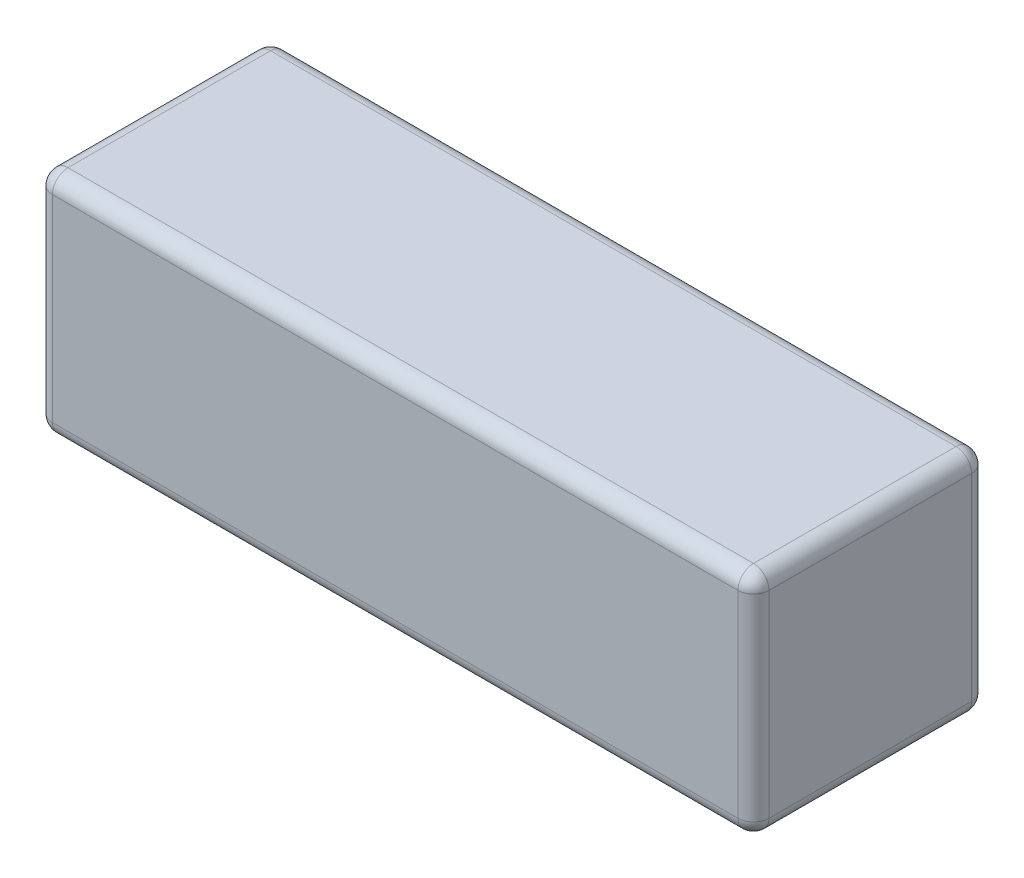
ISO-10303-21;
HEADER;
FILE_DESCRIPTION(('STEP AP214'),'2;1');
FILE_NAME('part.step','',(''),(''),'','','');
FILE_SCHEMA(('AUTOMOTIVE_DESIGN { 1 0 10303 214 1 1 1 1 }'));
ENDSEC;
DATA;
#1=APPLICATION_CONTEXT('core data for automotive mechanical design processes');
#2=APPLICATION_PROTOCOL_DEFINITION('international standard','automotive_design',2000,#1);
#3=PRODUCT_CONTEXT('',#1,'mechanical');
#4=PRODUCT('Part','Part','',(#3));
#5=PRODUCT_RELATED_PRODUCT_CATEGORY('part','',(#4));
#6=PRODUCT_DEFINITION_FORMATION('','',#4);
#7=PRODUCT_DEFINITION_CONTEXT('part definition',#1,'design');
#8=PRODUCT_DEFINITION('design','',#6,#7);
#9=PRODUCT_DEFINITION_SHAPE('','',#8);
#10=(LENGTH_UNIT() NAMED_UNIT(*) SI_UNIT(.MILLI.,.METRE.));
#11=(NAMED_UNIT(*) PLANE_ANGLE_UNIT() SI_UNIT($,.RADIAN.));
#12=(NAMED_UNIT(*) SI_UNIT($,.STERADIAN.) SOLID_ANGLE_UNIT());
#13=UNCERTAINTY_MEASURE_WITH_UNIT(LENGTH_MEASURE(1.E-05),#10,'distance_accuracy_value','');
#14=(GEOMETRIC_REPRESENTATION_CONTEXT(3) GLOBAL_UNCERTAINTY_ASSIGNED_CONTEXT((#13)) GLOBAL_UNIT_ASSIGNED_CONTEXT((#10,
#11,#12)) REPRESENTATION_CONTEXT('',''));
#15=CARTESIAN_POINT('',(0.,0.,0.));
#16=DIRECTION('',(0.,0.,1.));
#17=DIRECTION('',(1.,0.,0.));
#18=AXIS2_PLACEMENT_3D('',#15,#16,#17);
#19=CARTESIAN_POINT('',(-69.,-22.,45.));
#20=DIRECTION('',(1.,0.,0.));
#21=DIRECTION('',(0.,0.,-1.));
#22=AXIS2_PLACEMENT_3D('',#19,#20,#21);
#23=PLANE('',#22);
#24=DIRECTION('',(0.,-1.,0.));
#25=VECTOR('',#24,1.);
#26=CARTESIAN_POINT('',(-69.,22.,42.));
#27=LINE('',#26,#25);
#28=CARTESIAN_POINT('',(-69.,-19.,42.));
#29=VERTEX_POINT('',#28);
#30=CARTESIAN_POINT('',(-69.,19.,42.));
#31=VERTEX_POINT('',#30);
#32=EDGE_CURVE('E133',#29,#31,#27,.F.);
#33=ORIENTED_EDGE('',*,*,#32,.T.);
#34=DIRECTION('',(0.,0.,-1.));
#35=VECTOR('',#34,1.);
#36=CARTESIAN_POINT('',(-69.,19.,45.));
#37=LINE('',#36,#35);
#38=CARTESIAN_POINT('',(-69.,19.,3.));
#39=VERTEX_POINT('',#38);
#40=EDGE_CURVE('E170',#31,#39,#37,.T.);
#41=ORIENTED_EDGE('',*,*,#40,.T.);
#42=DIRECTION('',(0.,-1.,0.));
#43=VECTOR('',#42,1.);
#44=CARTESIAN_POINT('',(-69.,-22.,3.));
#45=LINE('',#44,#43);
#46=CARTESIAN_POINT('',(-69.,-19.,3.));
#47=VERTEX_POINT('',#46);
#48=EDGE_CURVE('E136',#39,#47,#45,.T.);
#49=ORIENTED_EDGE('',*,*,#48,.T.);
#50=DIRECTION('',(0.,0.,-1.));
#51=VECTOR('',#50,1.);
#52=CARTESIAN_POINT('',(-69.,-19.,45.));
#53=LINE('',#52,#51);
#54=EDGE_CURVE('E129',#47,#29,#53,.F.);
#55=ORIENTED_EDGE('',*,*,#54,.T.);
#56=EDGE_LOOP('',(#33,#41,#49,#55));
#57=FACE_BOUND('',#56,.T.);
#58=ADVANCED_FACE('F41',(#57),#23,.F.);
#59=CARTESIAN_POINT('',(69.,-22.,45.));
#60=DIRECTION('',(0.,1.,0.));
#61=DIRECTION('',(-1.,0.,0.));
#62=AXIS2_PLACEMENT_3D('',#59,#60,#61);
#63=PLANE('',#62);
#64=DIRECTION('',(1.,0.,0.));
#65=VECTOR('',#64,1.);
#66=CARTESIAN_POINT('',(-69.,-22.,42.));
#67=LINE('',#66,#65);
#68=CARTESIAN_POINT('',(66.,-22.,42.));
#69=VERTEX_POINT('',#68);
#70=CARTESIAN_POINT('',(-66.,-22.,42.));
#71=VERTEX_POINT('',#70);
#72=EDGE_CURVE('E190',#69,#71,#67,.F.);
#73=ORIENTED_EDGE('',*,*,#72,.T.);
#74=DIRECTION('',(0.,0.,-1.));
#75=VECTOR('',#74,1.);
#76=CARTESIAN_POINT('',(-66.,-22.,45.));
#77=LINE('',#76,#75);
#78=CARTESIAN_POINT('',(-66.,-22.,3.));
#79=VERTEX_POINT('',#78);
#80=EDGE_CURVE('E147',#71,#79,#77,.T.);
#81=ORIENTED_EDGE('',*,*,#80,.T.);
#82=DIRECTION('',(1.,0.,0.));
#83=VECTOR('',#82,1.);
#84=CARTESIAN_POINT('',(69.,-22.,3.));
#85=LINE('',#84,#83);
#86=CARTESIAN_POINT('',(66.,-22.,3.));
#87=VERTEX_POINT('',#86);
#88=EDGE_CURVE('E194',#79,#87,#85,.T.);
#89=ORIENTED_EDGE('',*,*,#88,.T.);
#90=DIRECTION('',(0.,0.,-1.));
#91=VECTOR('',#90,1.);
#92=CARTESIAN_POINT('',(66.,-22.,45.));
#93=LINE('',#92,#91);
#94=EDGE_CURVE('E192',#87,#69,#93,.F.);
#95=ORIENTED_EDGE('',*,*,#94,.T.);
#96=EDGE_LOOP('',(#73,#81,#89,#95));
#97=FACE_BOUND('',#96,.T.);
#98=ADVANCED_FACE('F304',(#97),#63,.F.);
#99=CARTESIAN_POINT('',(69.,-22.,45.));
#100=DIRECTION('',(-1.,0.,0.));
#101=DIRECTION('',(0.,0.,1.));
#102=AXIS2_PLACEMENT_3D('',#99,#100,#101);
#103=PLANE('',#102);
#104=DIRECTION('',(0.,0.,-1.));
#105=VECTOR('',#104,1.);
#106=CARTESIAN_POINT('',(69.,-19.,45.));
#107=LINE('',#106,#105);
#108=CARTESIAN_POINT('',(69.,-19.,42.));
#109=VERTEX_POINT('',#108);
#110=CARTESIAN_POINT('',(69.,-19.,3.));
#111=VERTEX_POINT('',#110);
#112=EDGE_CURVE('E201',#109,#111,#107,.T.);
#113=ORIENTED_EDGE('',*,*,#112,.T.);
#114=DIRECTION('',(0.,1.,0.));
#115=VECTOR('',#114,1.);
#116=CARTESIAN_POINT('',(69.,-22.,3.));
#117=LINE('',#116,#115);
#118=CARTESIAN_POINT('',(69.,19.,3.));
#119=VERTEX_POINT('',#118);
#120=EDGE_CURVE('E204',#111,#119,#117,.T.);
#121=ORIENTED_EDGE('',*,*,#120,.T.);
#122=DIRECTION('',(0.,0.,-1.));
#123=VECTOR('',#122,1.);
#124=CARTESIAN_POINT('',(69.,19.,45.));
#125=LINE('',#124,#123);
#126=CARTESIAN_POINT('',(69.,19.,42.));
#127=VERTEX_POINT('',#126);
#128=EDGE_CURVE('E199',#119,#127,#125,.F.);
#129=ORIENTED_EDGE('',*,*,#128,.T.);
#130=DIRECTION('',(0.,1.,0.));
#131=VECTOR('',#130,1.);
#132=CARTESIAN_POINT('',(69.,-22.,42.));
#133=LINE('',#132,#131);
#134=EDGE_CURVE('E197',#127,#109,#133,.F.);
#135=ORIENTED_EDGE('',*,*,#134,.T.);
#136=EDGE_LOOP('',(#113,#121,#129,#135));
#137=FACE_BOUND('',#136,.T.);
#138=ADVANCED_FACE('F281',(#137),#103,.F.);
#139=CARTESIAN_POINT('',(69.,22.,45.));
#140=DIRECTION('',(0.,-1.,0.));
#141=DIRECTION('',(1.,0.,0.));
#142=AXIS2_PLACEMENT_3D('',#139,#140,#141);
#143=PLANE('',#142);
#144=DIRECTION('',(-1.,0.,0.));
#145=VECTOR('',#144,1.);
#146=CARTESIAN_POINT('',(69.,22.,3.));
#147=LINE('',#146,#145);
#148=CARTESIAN_POINT('',(66.,22.,3.));
#149=VERTEX_POINT('',#148);
#150=CARTESIAN_POINT('',(-66.,22.,3.));
#151=VERTEX_POINT('',#150);
#152=EDGE_CURVE('E176',#149,#151,#147,.T.);
#153=ORIENTED_EDGE('',*,*,#152,.T.);
#154=DIRECTION('',(0.,0.,-1.));
#155=VECTOR('',#154,1.);
#156=CARTESIAN_POINT('',(-66.,22.,45.));
#157=LINE('',#156,#155);
#158=CARTESIAN_POINT('',(-66.,22.,42.));
#159=VERTEX_POINT('',#158);
#160=EDGE_CURVE('E178',#151,#159,#157,.F.);
#161=ORIENTED_EDGE('',*,*,#160,.T.);
#162=DIRECTION('',(-1.,0.,0.));
#163=VECTOR('',#162,1.);
#164=CARTESIAN_POINT('',(69.,22.,42.));
#165=LINE('',#164,#163);
#166=CARTESIAN_POINT('',(66.,22.,42.));
#167=VERTEX_POINT('',#166);
#168=EDGE_CURVE('E172',#159,#167,#165,.F.);
#169=ORIENTED_EDGE('',*,*,#168,.T.);
#170=DIRECTION('',(0.,0.,-1.));
#171=VECTOR('',#170,1.);
#172=CARTESIAN_POINT('',(66.,22.,45.));
#173=LINE('',#172,#171);
#174=EDGE_CURVE('E174',#167,#149,#173,.T.);
#175=ORIENTED_EDGE('',*,*,#174,.T.);
#176=EDGE_LOOP('',(#153,#161,#169,#175));
#177=FACE_BOUND('',#176,.T.);
#178=ADVANCED_FACE('F311',(#177),#143,.F.);
#179=CARTESIAN_POINT('',(0.,0.,45.));
#180=DIRECTION('',(0.,0.,1.));
#181=DIRECTION('',(1.,0.,0.));
#182=AXIS2_PLACEMENT_3D('',#179,#180,#181);
#183=PLANE('',#182);
#184=DIRECTION('',(0.,1.,0.));
#185=VECTOR('',#184,1.);
#186=CARTESIAN_POINT('',(66.,22.,45.));
#187=LINE('',#186,#185);
#188=CARTESIAN_POINT('',(66.,-19.,45.));
#189=VERTEX_POINT('',#188);
#190=CARTESIAN_POINT('',(66.,19.,45.));
#191=VERTEX_POINT('',#190);
#192=EDGE_CURVE('E50',#189,#191,#187,.T.);
#193=ORIENTED_EDGE('',*,*,#192,.T.);
#194=DIRECTION('',(-1.,0.,0.));
#195=VECTOR('',#194,1.);
#196=CARTESIAN_POINT('',(-69.,19.,45.));
#197=LINE('',#196,#195);
#198=CARTESIAN_POINT('',(-66.,19.,45.));
#199=VERTEX_POINT('',#198);
#200=EDGE_CURVE('E11',#191,#199,#197,.T.);
#201=ORIENTED_EDGE('',*,*,#200,.T.);
#202=DIRECTION('',(0.,-1.,0.));
#203=VECTOR('',#202,1.);
#204=CARTESIAN_POINT('',(-66.,-22.,45.));
#205=LINE('',#204,#203);
#206=CARTESIAN_POINT('',(-66.,-19.,45.));
#207=VERTEX_POINT('',#206);
#208=EDGE_CURVE('E206',#199,#207,#205,.T.);
#209=ORIENTED_EDGE('',*,*,#208,.T.);
#210=DIRECTION('',(1.,0.,0.));
#211=VECTOR('',#210,1.);
#212=CARTESIAN_POINT('',(69.,-19.,45.));
#213=LINE('',#212,#211);
#214=EDGE_CURVE('E61',#207,#189,#213,.T.);
#215=ORIENTED_EDGE('',*,*,#214,.T.);
#216=EDGE_LOOP('',(#193,#201,#209,#215));
#217=FACE_BOUND('',#216,.T.);
#218=ADVANCED_FACE('F374',(#217),#183,.T.);
#219=CARTESIAN_POINT('',(0.,0.,0.));
#220=DIRECTION('',(0.,0.,1.));
#221=DIRECTION('',(1.,0.,0.));
#222=AXIS2_PLACEMENT_3D('',#219,#220,#221);
#223=PLANE('',#222);
#224=DIRECTION('',(0.,-1.,0.));
#225=VECTOR('',#224,1.);
#226=CARTESIAN_POINT('',(-66.,0.,0.));
#227=LINE('',#226,#225);
#228=CARTESIAN_POINT('',(-66.,-19.,0.));
#229=VERTEX_POINT('',#228);
#230=CARTESIAN_POINT('',(-66.,19.,0.));
#231=VERTEX_POINT('',#230);
#232=EDGE_CURVE('E185',#229,#231,#227,.F.);
#233=ORIENTED_EDGE('',*,*,#232,.T.);
#234=DIRECTION('',(-1.,0.,0.));
#235=VECTOR('',#234,1.);
#236=CARTESIAN_POINT('',(0.,19.,0.));
#237=LINE('',#236,#235);
#238=CARTESIAN_POINT('',(66.,19.,0.));
#239=VERTEX_POINT('',#238);
#240=EDGE_CURVE('E187',#231,#239,#237,.F.);
#241=ORIENTED_EDGE('',*,*,#240,.T.);
#242=DIRECTION('',(0.,1.,0.));
#243=VECTOR('',#242,1.);
#244=CARTESIAN_POINT('',(66.,0.,0.));
#245=LINE('',#244,#243);
#246=CARTESIAN_POINT('',(66.,-19.,0.));
#247=VERTEX_POINT('',#246);
#248=EDGE_CURVE('E181',#239,#247,#245,.F.);
#249=ORIENTED_EDGE('',*,*,#248,.T.);
#250=DIRECTION('',(1.,0.,0.));
#251=VECTOR('',#250,1.);
#252=CARTESIAN_POINT('',(0.,-19.,0.));
#253=LINE('',#252,#251);
#254=EDGE_CURVE('E183',#247,#229,#253,.F.);
#255=ORIENTED_EDGE('',*,*,#254,.T.);
#256=EDGE_LOOP('',(#233,#241,#249,#255));
#257=FACE_BOUND('',#256,.T.);
#258=ADVANCED_FACE('F272',(#257),#223,.F.);
#259=CARTESIAN_POINT('',(66.,-19.,45.));
#260=DIRECTION('',(0.,0.,-1.));
#261=DIRECTION('',(-1.,0.,0.));
#262=AXIS2_PLACEMENT_3D('',#259,#260,#261);
#263=CYLINDRICAL_SURFACE('',#262,3.);
#264=CARTESIAN_POINT('',(66.,-19.,42.));
#265=DIRECTION('',(0.,0.,1.));
#266=DIRECTION('',(1.,0.,0.));
#267=AXIS2_PLACEMENT_3D('',#264,#265,#266);
#268=CIRCLE('',#267,3.);
#269=EDGE_CURVE('E45',#69,#109,#268,.T.);
#270=ORIENTED_EDGE('',*,*,#269,.F.);
#271=ORIENTED_EDGE('',*,*,#94,.F.);
#272=CARTESIAN_POINT('',(66.,-19.,3.));
#273=DIRECTION('',(0.,0.,-1.));
#274=DIRECTION('',(-1.,0.,0.));
#275=AXIS2_PLACEMENT_3D('',#272,#273,#274);
#276=CIRCLE('',#275,3.);
#277=EDGE_CURVE('E167',#111,#87,#276,.T.);
#278=ORIENTED_EDGE('',*,*,#277,.F.);
#279=ORIENTED_EDGE('',*,*,#112,.F.);
#280=EDGE_LOOP('',(#270,#271,#278,#279));
#281=FACE_BOUND('',#280,.T.);
#282=ADVANCED_FACE('F43',(#281),#263,.T.);
#283=CARTESIAN_POINT('',(66.,-19.,42.));
#284=DIRECTION('',(1.,0.,0.));
#285=DIRECTION('',(0.,0.,-1.));
#286=AXIS2_PLACEMENT_3D('',#283,#284,#285);
#287=SPHERICAL_SURFACE('',#286,3.);
#288=CARTESIAN_POINT('',(66.,-19.,42.));
#289=DIRECTION('',(1.,0.,0.));
#290=DIRECTION('',(0.,0.,-1.));
#291=AXIS2_PLACEMENT_3D('',#288,#289,#290);
#292=CIRCLE('',#291,3.);
#293=EDGE_CURVE('E252',#69,#189,#292,.F.);
#294=ORIENTED_EDGE('',*,*,#293,.F.);
#295=ORIENTED_EDGE('',*,*,#269,.T.);
#296=CARTESIAN_POINT('',(66.,-19.,42.));
#297=DIRECTION('',(0.,-1.,0.));
#298=DIRECTION('',(0.,0.,-1.));
#299=AXIS2_PLACEMENT_3D('',#296,#297,#298);
#300=CIRCLE('',#299,3.);
#301=EDGE_CURVE('E254',#189,#109,#300,.F.);
#302=ORIENTED_EDGE('',*,*,#301,.F.);
#303=EDGE_LOOP('',(#294,#295,#302));
#304=FACE_BOUND('',#303,.T.);
#305=ADVANCED_FACE('F299',(#304),#287,.T.);
#306=CARTESIAN_POINT('',(66.,-19.,3.));
#307=DIRECTION('',(0.,-1.,0.));
#308=DIRECTION('',(0.,0.,-1.));
#309=AXIS2_PLACEMENT_3D('',#306,#307,#308);
#310=SPHERICAL_SURFACE('',#309,3.);
#311=CARTESIAN_POINT('',(66.,-19.,3.));
#312=DIRECTION('',(0.,-1.,0.));
#313=DIRECTION('',(0.,0.,-1.));
#314=AXIS2_PLACEMENT_3D('',#311,#312,#313);
#315=CIRCLE('',#314,3.);
#316=EDGE_CURVE('E246',#111,#247,#315,.F.);
#317=ORIENTED_EDGE('',*,*,#316,.F.);
#318=ORIENTED_EDGE('',*,*,#277,.T.);
#319=CARTESIAN_POINT('',(66.,-19.,3.));
#320=DIRECTION('',(1.,0.,0.));
#321=DIRECTION('',(0.,0.,-1.));
#322=AXIS2_PLACEMENT_3D('',#319,#320,#321);
#323=CIRCLE('',#322,3.);
#324=EDGE_CURVE('E249',#247,#87,#323,.F.);
#325=ORIENTED_EDGE('',*,*,#324,.F.);
#326=EDGE_LOOP('',(#317,#318,#325));
#327=FACE_BOUND('',#326,.T.);
#328=ADVANCED_FACE('F261',(#327),#310,.T.);
#329=CARTESIAN_POINT('',(66.,0.,42.));
#330=DIRECTION('',(0.,-1.,0.));
#331=DIRECTION('',(0.,0.,-1.));
#332=AXIS2_PLACEMENT_3D('',#329,#330,#331);
#333=CYLINDRICAL_SURFACE('',#332,3.);
#334=ORIENTED_EDGE('',*,*,#301,.T.);
#335=ORIENTED_EDGE('',*,*,#134,.F.);
#336=CARTESIAN_POINT('',(66.,19.,42.));
#337=DIRECTION('',(0.,1.,0.));
#338=DIRECTION('',(0.,0.,1.));
#339=AXIS2_PLACEMENT_3D('',#336,#337,#338);
#340=CIRCLE('',#339,3.);
#341=EDGE_CURVE('E240',#191,#127,#340,.T.);
#342=ORIENTED_EDGE('',*,*,#341,.F.);
#343=ORIENTED_EDGE('',*,*,#192,.F.);
#344=EDGE_LOOP('',(#334,#335,#342,#343));
#345=FACE_BOUND('',#344,.T.);
#346=ADVANCED_FACE('F294',(#345),#333,.T.);
#347=CARTESIAN_POINT('',(0.,-19.,42.));
#348=DIRECTION('',(-1.,0.,0.));
#349=DIRECTION('',(0.,-1.,0.));
#350=AXIS2_PLACEMENT_3D('',#347,#348,#349);
#351=CYLINDRICAL_SURFACE('',#350,3.);
#352=ORIENTED_EDGE('',*,*,#293,.T.);
#353=ORIENTED_EDGE('',*,*,#214,.F.);
#354=CARTESIAN_POINT('',(-66.,-19.,42.));
#355=DIRECTION('',(-1.,0.,0.));
#356=DIRECTION('',(0.,0.,1.));
#357=AXIS2_PLACEMENT_3D('',#354,#355,#356);
#358=CIRCLE('',#357,3.);
#359=EDGE_CURVE('E151',#71,#207,#358,.T.);
#360=ORIENTED_EDGE('',*,*,#359,.F.);
#361=ORIENTED_EDGE('',*,*,#72,.F.);
#362=EDGE_LOOP('',(#352,#353,#360,#361));
#363=FACE_BOUND('',#362,.T.);
#364=ADVANCED_FACE('F302',(#363),#351,.T.);
#365=CARTESIAN_POINT('',(-66.,-19.,45.));
#366=DIRECTION('',(0.,0.,-1.));
#367=DIRECTION('',(-1.,0.,0.));
#368=AXIS2_PLACEMENT_3D('',#365,#366,#367);
#369=CYLINDRICAL_SURFACE('',#368,3.);
#370=CARTESIAN_POINT('',(-66.,-19.,3.));
#371=DIRECTION('',(0.,0.,-1.));
#372=DIRECTION('',(-1.,0.,0.));
#373=AXIS2_PLACEMENT_3D('',#370,#371,#372);
#374=CIRCLE('',#373,3.);
#375=EDGE_CURVE('E152',#79,#47,#374,.T.);
#376=ORIENTED_EDGE('',*,*,#375,.F.);
#377=ORIENTED_EDGE('',*,*,#80,.F.);
#378=CARTESIAN_POINT('',(-66.,-19.,42.));
#379=DIRECTION('',(0.,0.,1.));
#380=DIRECTION('',(1.,0.,0.));
#381=AXIS2_PLACEMENT_3D('',#378,#379,#380);
#382=CIRCLE('',#381,3.);
#383=EDGE_CURVE('E143',#29,#71,#382,.T.);
#384=ORIENTED_EDGE('',*,*,#383,.F.);
#385=ORIENTED_EDGE('',*,*,#54,.F.);
#386=EDGE_LOOP('',(#376,#377,#384,#385));
#387=FACE_BOUND('',#386,.T.);
#388=ADVANCED_FACE('F145',(#387),#369,.T.);
#389=CARTESIAN_POINT('',(69.,-19.,3.));
#390=DIRECTION('',(1.,0.,0.));
#391=DIRECTION('',(0.,1.,0.));
#392=AXIS2_PLACEMENT_3D('',#389,#390,#391);
#393=CYLINDRICAL_SURFACE('',#392,3.);
#394=ORIENTED_EDGE('',*,*,#324,.T.);
#395=ORIENTED_EDGE('',*,*,#88,.F.);
#396=CARTESIAN_POINT('',(-66.,-19.,3.));
#397=DIRECTION('',(-1.,0.,0.));
#398=DIRECTION('',(0.,-1.,0.));
#399=AXIS2_PLACEMENT_3D('',#396,#397,#398);
#400=CIRCLE('',#399,3.);
#401=EDGE_CURVE('E236',#229,#79,#400,.T.);
#402=ORIENTED_EDGE('',*,*,#401,.F.);
#403=ORIENTED_EDGE('',*,*,#254,.F.);
#404=EDGE_LOOP('',(#394,#395,#402,#403));
#405=FACE_BOUND('',#404,.T.);
#406=ADVANCED_FACE('F268',(#405),#393,.T.);
#407=CARTESIAN_POINT('',(66.,-22.,3.));
#408=DIRECTION('',(0.,1.,0.));
#409=DIRECTION('',(0.,0.,1.));
#410=AXIS2_PLACEMENT_3D('',#407,#408,#409);
#411=CYLINDRICAL_SURFACE('',#410,3.);
#412=ORIENTED_EDGE('',*,*,#316,.T.);
#413=ORIENTED_EDGE('',*,*,#248,.F.);
#414=CARTESIAN_POINT('',(66.,19.,3.));
#415=DIRECTION('',(0.,1.,0.));
#416=DIRECTION('',(0.,0.,1.));
#417=AXIS2_PLACEMENT_3D('',#414,#415,#416);
#418=CIRCLE('',#417,3.);
#419=EDGE_CURVE('E233',#119,#239,#418,.T.);
#420=ORIENTED_EDGE('',*,*,#419,.F.);
#421=ORIENTED_EDGE('',*,*,#120,.F.);
#422=EDGE_LOOP('',(#412,#413,#420,#421));
#423=FACE_BOUND('',#422,.T.);
#424=ADVANCED_FACE('F278',(#423),#411,.T.);
#425=CARTESIAN_POINT('',(66.,19.,45.));
#426=DIRECTION('',(0.,0.,-1.));
#427=DIRECTION('',(-1.,0.,0.));
#428=AXIS2_PLACEMENT_3D('',#425,#426,#427);
#429=CYLINDRICAL_SURFACE('',#428,3.);
#430=CARTESIAN_POINT('',(66.,19.,42.));
#431=DIRECTION('',(0.,0.,1.));
#432=DIRECTION('',(1.,0.,0.));
#433=AXIS2_PLACEMENT_3D('',#430,#431,#432);
#434=CIRCLE('',#433,3.);
#435=EDGE_CURVE('E243',#127,#167,#434,.T.);
#436=ORIENTED_EDGE('',*,*,#435,.F.);
#437=ORIENTED_EDGE('',*,*,#128,.F.);
#438=CARTESIAN_POINT('',(66.,19.,3.));
#439=DIRECTION('',(0.,0.,-1.));
#440=DIRECTION('',(-1.,0.,0.));
#441=AXIS2_PLACEMENT_3D('',#438,#439,#440);
#442=CIRCLE('',#441,3.);
#443=EDGE_CURVE('E230',#149,#119,#442,.T.);
#444=ORIENTED_EDGE('',*,*,#443,.F.);
#445=ORIENTED_EDGE('',*,*,#174,.F.);
#446=EDGE_LOOP('',(#436,#437,#444,#445));
#447=FACE_BOUND('',#446,.T.);
#448=ADVANCED_FACE('F286',(#447),#429,.T.);
#449=CARTESIAN_POINT('',(66.,19.,42.));
#450=DIRECTION('',(1.,0.,0.));
#451=DIRECTION('',(0.,0.,-1.));
#452=AXIS2_PLACEMENT_3D('',#449,#450,#451);
#453=SPHERICAL_SURFACE('',#452,3.);
#454=ORIENTED_EDGE('',*,*,#341,.T.);
#455=ORIENTED_EDGE('',*,*,#435,.T.);
#456=CARTESIAN_POINT('',(66.,19.,42.));
#457=DIRECTION('',(1.,0.,0.));
#458=DIRECTION('',(0.,0.,-1.));
#459=AXIS2_PLACEMENT_3D('',#456,#457,#458);
#460=CIRCLE('',#459,3.);
#461=EDGE_CURVE('E159',#191,#167,#460,.F.);
#462=ORIENTED_EDGE('',*,*,#461,.F.);
#463=EDGE_LOOP('',(#454,#455,#462));
#464=FACE_BOUND('',#463,.T.);
#465=ADVANCED_FACE('F291',(#464),#453,.T.);
#466=CARTESIAN_POINT('',(-66.,-19.,42.));
#467=DIRECTION('',(0.,-1.,0.));
#468=DIRECTION('',(1.,0.,0.));
#469=AXIS2_PLACEMENT_3D('',#466,#467,#468);
#470=SPHERICAL_SURFACE('',#469,3.);
#471=ORIENTED_EDGE('',*,*,#383,.T.);
#472=ORIENTED_EDGE('',*,*,#359,.T.);
#473=CARTESIAN_POINT('',(-66.,-19.,42.));
#474=DIRECTION('',(0.,-1.,0.));
#475=DIRECTION('',(0.,0.,-1.));
#476=AXIS2_PLACEMENT_3D('',#473,#474,#475);
#477=CIRCLE('',#476,3.);
#478=EDGE_CURVE('E155',#29,#207,#477,.F.);
#479=ORIENTED_EDGE('',*,*,#478,.F.);
#480=EDGE_LOOP('',(#471,#472,#479));
#481=FACE_BOUND('',#480,.T.);
#482=ADVANCED_FACE('F156',(#481),#470,.T.);
#483=CARTESIAN_POINT('',(-66.,-19.,3.));
#484=DIRECTION('',(0.,-1.,0.));
#485=DIRECTION('',(1.,0.,0.));
#486=AXIS2_PLACEMENT_3D('',#483,#484,#485);
#487=SPHERICAL_SURFACE('',#486,3.);
#488=ORIENTED_EDGE('',*,*,#401,.T.);
#489=ORIENTED_EDGE('',*,*,#375,.T.);
#490=CARTESIAN_POINT('',(-66.,-19.,3.));
#491=DIRECTION('',(0.,-1.,0.));
#492=DIRECTION('',(0.,0.,-1.));
#493=AXIS2_PLACEMENT_3D('',#490,#491,#492);
#494=CIRCLE('',#493,3.);
#495=EDGE_CURVE('E160',#229,#47,#494,.F.);
#496=ORIENTED_EDGE('',*,*,#495,.F.);
#497=EDGE_LOOP('',(#488,#489,#496));
#498=FACE_BOUND('',#497,.T.);
#499=ADVANCED_FACE('F345',(#498),#487,.T.);
#500=CARTESIAN_POINT('',(66.,19.,3.));
#501=DIRECTION('',(1.,0.,0.));
#502=DIRECTION('',(0.,0.,-1.));
#503=AXIS2_PLACEMENT_3D('',#500,#501,#502);
#504=SPHERICAL_SURFACE('',#503,3.);
#505=ORIENTED_EDGE('',*,*,#443,.T.);
#506=ORIENTED_EDGE('',*,*,#419,.T.);
#507=CARTESIAN_POINT('',(66.,19.,3.));
#508=DIRECTION('',(1.,0.,0.));
#509=DIRECTION('',(0.,0.,-1.));
#510=AXIS2_PLACEMENT_3D('',#507,#508,#509);
#511=CIRCLE('',#510,3.);
#512=EDGE_CURVE('E224',#149,#239,#511,.F.);
#513=ORIENTED_EDGE('',*,*,#512,.F.);
#514=EDGE_LOOP('',(#505,#506,#513));
#515=FACE_BOUND('',#514,.T.);
#516=ADVANCED_FACE('F341',(#515),#504,.T.);
#517=CARTESIAN_POINT('',(0.,19.,42.));
#518=DIRECTION('',(1.,0.,0.));
#519=DIRECTION('',(0.,1.,0.));
#520=AXIS2_PLACEMENT_3D('',#517,#518,#519);
#521=CYLINDRICAL_SURFACE('',#520,3.);
#522=ORIENTED_EDGE('',*,*,#461,.T.);
#523=ORIENTED_EDGE('',*,*,#168,.F.);
#524=CARTESIAN_POINT('',(-66.,19.,42.));
#525=DIRECTION('',(-1.,0.,0.));
#526=DIRECTION('',(0.,0.,1.));
#527=AXIS2_PLACEMENT_3D('',#524,#525,#526);
#528=CIRCLE('',#527,3.);
#529=EDGE_CURVE('E221',#199,#159,#528,.T.);
#530=ORIENTED_EDGE('',*,*,#529,.F.);
#531=ORIENTED_EDGE('',*,*,#200,.F.);
#532=EDGE_LOOP('',(#522,#523,#530,#531));
#533=FACE_BOUND('',#532,.T.);
#534=ADVANCED_FACE('F338',(#533),#521,.T.);
#535=CARTESIAN_POINT('',(-66.,0.,42.));
#536=DIRECTION('',(0.,1.,0.));
#537=DIRECTION('',(0.,0.,1.));
#538=AXIS2_PLACEMENT_3D('',#535,#536,#537);
#539=CYLINDRICAL_SURFACE('',#538,3.);
#540=ORIENTED_EDGE('',*,*,#478,.T.);
#541=ORIENTED_EDGE('',*,*,#208,.F.);
#542=CARTESIAN_POINT('',(-66.,19.,42.));
#543=DIRECTION('',(0.,1.,0.));
#544=DIRECTION('',(0.,0.,1.));
#545=AXIS2_PLACEMENT_3D('',#542,#543,#544);
#546=CIRCLE('',#545,3.);
#547=EDGE_CURVE('E163',#31,#199,#546,.T.);
#548=ORIENTED_EDGE('',*,*,#547,.F.);
#549=ORIENTED_EDGE('',*,*,#32,.F.);
#550=EDGE_LOOP('',(#540,#541,#548,#549));
#551=FACE_BOUND('',#550,.T.);
#552=ADVANCED_FACE('F162',(#551),#539,.T.);
#553=CARTESIAN_POINT('',(-66.,-22.,3.));
#554=DIRECTION('',(0.,-1.,0.));
#555=DIRECTION('',(0.,0.,-1.));
#556=AXIS2_PLACEMENT_3D('',#553,#554,#555);
#557=CYLINDRICAL_SURFACE('',#556,3.);
#558=ORIENTED_EDGE('',*,*,#495,.T.);
#559=ORIENTED_EDGE('',*,*,#48,.F.);
#560=CARTESIAN_POINT('',(-66.,19.,3.));
#561=DIRECTION('',(0.,1.,0.));
#562=DIRECTION('',(-1.,0.,0.));
#563=AXIS2_PLACEMENT_3D('',#560,#561,#562);
#564=CIRCLE('',#563,3.);
#565=EDGE_CURVE('E217',#231,#39,#564,.T.);
#566=ORIENTED_EDGE('',*,*,#565,.F.);
#567=ORIENTED_EDGE('',*,*,#232,.F.);
#568=EDGE_LOOP('',(#558,#559,#566,#567));
#569=FACE_BOUND('',#568,.T.);
#570=ADVANCED_FACE('F331',(#569),#557,.T.);
#571=CARTESIAN_POINT('',(69.,19.,3.));
#572=DIRECTION('',(-1.,0.,0.));
#573=DIRECTION('',(0.,-1.,0.));
#574=AXIS2_PLACEMENT_3D('',#571,#572,#573);
#575=CYLINDRICAL_SURFACE('',#574,3.);
#576=ORIENTED_EDGE('',*,*,#512,.T.);
#577=ORIENTED_EDGE('',*,*,#240,.F.);
#578=CARTESIAN_POINT('',(-66.,19.,3.));
#579=DIRECTION('',(-1.,0.,0.));
#580=DIRECTION('',(0.,0.,1.));
#581=AXIS2_PLACEMENT_3D('',#578,#579,#580);
#582=CIRCLE('',#581,3.);
#583=EDGE_CURVE('E214',#151,#231,#582,.T.);
#584=ORIENTED_EDGE('',*,*,#583,.F.);
#585=ORIENTED_EDGE('',*,*,#152,.F.);
#586=EDGE_LOOP('',(#576,#577,#584,#585));
#587=FACE_BOUND('',#586,.T.);
#588=ADVANCED_FACE('F327',(#587),#575,.T.);
#589=CARTESIAN_POINT('',(-66.,19.,42.));
#590=DIRECTION('',(0.,0.,1.));
#591=DIRECTION('',(1.,0.,0.));
#592=AXIS2_PLACEMENT_3D('',#589,#590,#591);
#593=SPHERICAL_SURFACE('',#592,3.);
#594=ORIENTED_EDGE('',*,*,#547,.T.);
#595=ORIENTED_EDGE('',*,*,#529,.T.);
#596=CARTESIAN_POINT('',(-66.,19.,42.));
#597=DIRECTION('',(0.,0.,1.));
#598=DIRECTION('',(1.,0.,0.));
#599=AXIS2_PLACEMENT_3D('',#596,#597,#598);
#600=CIRCLE('',#599,3.);
#601=EDGE_CURVE('E212',#31,#159,#600,.F.);
#602=ORIENTED_EDGE('',*,*,#601,.F.);
#603=EDGE_LOOP('',(#594,#595,#602));
#604=FACE_BOUND('',#603,.T.);
#605=ADVANCED_FACE('F323',(#604),#593,.T.);
#606=CARTESIAN_POINT('',(-66.,19.,3.));
#607=DIRECTION('',(0.,0.,-1.));
#608=DIRECTION('',(-1.,0.,0.));
#609=AXIS2_PLACEMENT_3D('',#606,#607,#608);
#610=SPHERICAL_SURFACE('',#609,3.);
#611=ORIENTED_EDGE('',*,*,#583,.T.);
#612=ORIENTED_EDGE('',*,*,#565,.T.);
#613=CARTESIAN_POINT('',(-66.,19.,3.));
#614=DIRECTION('',(0.,0.,-1.));
#615=DIRECTION('',(-1.,0.,0.));
#616=AXIS2_PLACEMENT_3D('',#613,#614,#615);
#617=CIRCLE('',#616,3.);
#618=EDGE_CURVE('E210',#151,#39,#617,.F.);
#619=ORIENTED_EDGE('',*,*,#618,.F.);
#620=EDGE_LOOP('',(#611,#612,#619));
#621=FACE_BOUND('',#620,.T.);
#622=ADVANCED_FACE('F319',(#621),#610,.T.);
#623=CARTESIAN_POINT('',(-66.,19.,45.));
#624=DIRECTION('',(0.,0.,-1.));
#625=DIRECTION('',(-1.,0.,0.));
#626=AXIS2_PLACEMENT_3D('',#623,#624,#625);
#627=CYLINDRICAL_SURFACE('',#626,3.);
#628=ORIENTED_EDGE('',*,*,#601,.T.);
#629=ORIENTED_EDGE('',*,*,#160,.F.);
#630=ORIENTED_EDGE('',*,*,#618,.T.);
#631=ORIENTED_EDGE('',*,*,#40,.F.);
#632=EDGE_LOOP('',(#628,#629,#630,#631));
#633=FACE_BOUND('',#632,.T.);
#634=ADVANCED_FACE('F316',(#633),#627,.T.);
#635=CLOSED_SHELL('',(#58,#98,#138,#178,#218,#258,#282,#305,#328,#346,#364,#388,#406,#424,#448,
#465,#482,#499,#516,#534,#552,#570,#588,#605,#622,#634));
#636=MANIFOLD_SOLID_BREP('B2',#635);
#637=ADVANCED_BREP_SHAPE_REPRESENTATION('',(#18,#636),#14);
#638=SHAPE_DEFINITION_REPRESENTATION(#9,#637);
ENDSEC;
END-ISO-10303-21;
